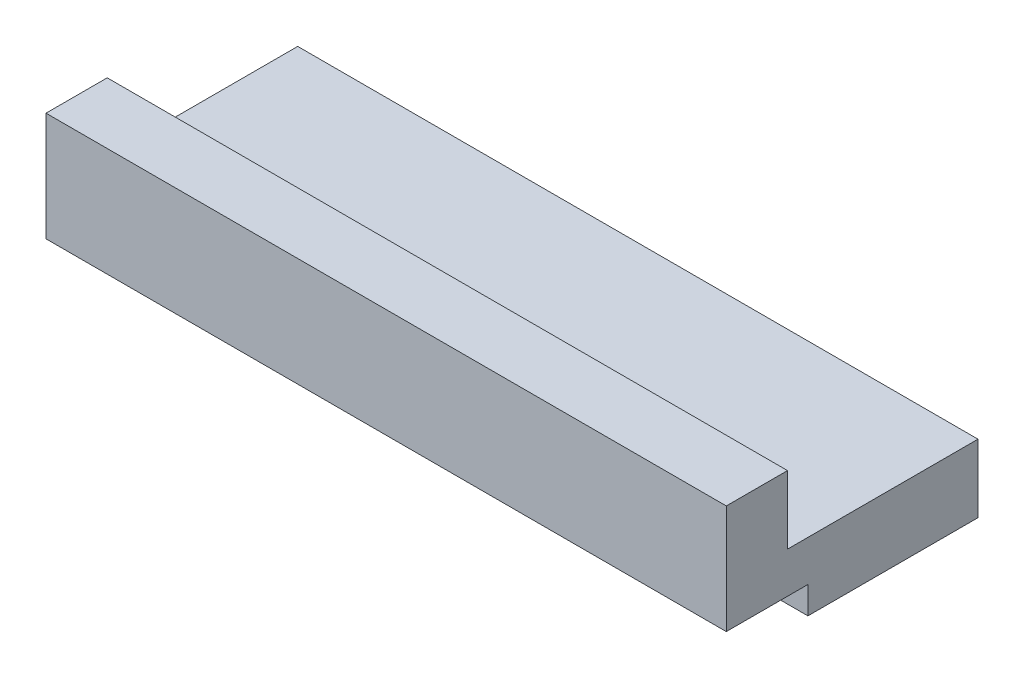
ISO-10303-21;
HEADER;
FILE_DESCRIPTION(('STEP AP214'),'2;1');
FILE_NAME('part.step','',(''),(''),'','','');
FILE_SCHEMA(('AUTOMOTIVE_DESIGN { 1 0 10303 214 1 1 1 1 }'));
ENDSEC;
DATA;
#1=APPLICATION_CONTEXT('core data for automotive mechanical design processes');
#2=APPLICATION_PROTOCOL_DEFINITION('international standard','automotive_design',2000,#1);
#3=PRODUCT_CONTEXT('',#1,'mechanical');
#4=PRODUCT('Part','Part','',(#3));
#5=PRODUCT_RELATED_PRODUCT_CATEGORY('part','',(#4));
#6=PRODUCT_DEFINITION_FORMATION('','',#4);
#7=PRODUCT_DEFINITION_CONTEXT('part definition',#1,'design');
#8=PRODUCT_DEFINITION('design','',#6,#7);
#9=PRODUCT_DEFINITION_SHAPE('','',#8);
#10=(LENGTH_UNIT() NAMED_UNIT(*) SI_UNIT(.MILLI.,.METRE.));
#11=(NAMED_UNIT(*) PLANE_ANGLE_UNIT() SI_UNIT($,.RADIAN.));
#12=(NAMED_UNIT(*) SI_UNIT($,.STERADIAN.) SOLID_ANGLE_UNIT());
#13=UNCERTAINTY_MEASURE_WITH_UNIT(LENGTH_MEASURE(1.E-05),#10,'distance_accuracy_value','');
#14=(GEOMETRIC_REPRESENTATION_CONTEXT(3) GLOBAL_UNCERTAINTY_ASSIGNED_CONTEXT((#13)) GLOBAL_UNIT_ASSIGNED_CONTEXT((#10,
#11,#12)) REPRESENTATION_CONTEXT('',''));
#15=CARTESIAN_POINT('',(0.,0.,0.));
#16=DIRECTION('',(0.,0.,1.));
#17=DIRECTION('',(1.,0.,0.));
#18=AXIS2_PLACEMENT_3D('',#15,#16,#17);
#19=CARTESIAN_POINT('',(-15.0860606060606,4.064,-2.6939393939394));
#20=DIRECTION('',(0.,0.,1.));
#21=DIRECTION('',(1.,0.,0.));
#22=AXIS2_PLACEMENT_3D('',#19,#20,#21);
#23=PLANE('',#22);
#24=DIRECTION('',(1.,0.,0.));
#25=VECTOR('',#24,1.);
#26=CARTESIAN_POINT('',(-15.0860606060606,1.524,-2.6939393939394));
#27=LINE('',#26,#25);
#28=CARTESIAN_POINT('',(-15.0860606060606,1.524,-2.6939393939394));
#29=VERTEX_POINT('',#28);
#30=CARTESIAN_POINT('',(10.3139393939394,1.524,-2.6939393939394));
#31=VERTEX_POINT('',#30);
#32=EDGE_CURVE('E50',#29,#31,#27,.T.);
#33=ORIENTED_EDGE('',*,*,#32,.F.);
#34=DIRECTION('',(0.,-1.,0.));
#35=VECTOR('',#34,1.);
#36=CARTESIAN_POINT('',(-15.0860606060606,4.064,-2.6939393939394));
#37=LINE('',#36,#35);
#38=CARTESIAN_POINT('',(-15.0860606060606,4.064,-2.6939393939394));
#39=VERTEX_POINT('',#38);
#40=EDGE_CURVE('E158',#39,#29,#37,.T.);
#41=ORIENTED_EDGE('',*,*,#40,.F.);
#42=DIRECTION('',(-1.,0.,0.));
#43=VECTOR('',#42,1.);
#44=CARTESIAN_POINT('',(-15.0860606060606,4.064,-2.6939393939394));
#45=LINE('',#44,#43);
#46=CARTESIAN_POINT('',(10.3139393939394,4.064,-2.6939393939394));
#47=VERTEX_POINT('',#46);
#48=EDGE_CURVE('E59',#47,#39,#45,.T.);
#49=ORIENTED_EDGE('',*,*,#48,.F.);
#50=DIRECTION('',(0.,-1.,0.));
#51=VECTOR('',#50,1.);
#52=CARTESIAN_POINT('',(10.3139393939394,4.064,-2.6939393939394));
#53=LINE('',#52,#51);
#54=EDGE_CURVE('E163',#47,#31,#53,.T.);
#55=ORIENTED_EDGE('',*,*,#54,.T.);
#56=EDGE_LOOP('',(#33,#41,#49,#55));
#57=FACE_BOUND('',#56,.T.);
#58=ADVANCED_FACE('F35',(#57),#23,.F.);
#59=CARTESIAN_POINT('',(-15.0860606060606,4.064,-0.407939393939396));
#60=DIRECTION('',(1.,0.,0.));
#61=DIRECTION('',(0.,0.,-1.));
#62=AXIS2_PLACEMENT_3D('',#59,#60,#61);
#63=PLANE('',#62);
#64=DIRECTION('',(0.,0.,1.));
#65=VECTOR('',#64,1.);
#66=CARTESIAN_POINT('',(-15.0860606060606,-1.016,-9.8059393939394));
#67=LINE('',#66,#65);
#68=CARTESIAN_POINT('',(-15.0860606060606,-1.016,-9.8059393939394));
#69=VERTEX_POINT('',#68);
#70=CARTESIAN_POINT('',(-15.0860606060606,-1.016,-3.4559393939394));
#71=VERTEX_POINT('',#70);
#72=EDGE_CURVE('E128',#69,#71,#67,.T.);
#73=ORIENTED_EDGE('',*,*,#72,.T.);
#74=DIRECTION('',(0.,-1.,0.));
#75=VECTOR('',#74,1.);
#76=CARTESIAN_POINT('',(-15.0860606060606,-1.016,-3.4559393939394));
#77=LINE('',#76,#75);
#78=CARTESIAN_POINT('',(-15.0860606060606,0.,-3.4559393939394));
#79=VERTEX_POINT('',#78);
#80=EDGE_CURVE('E119',#79,#71,#77,.T.);
#81=ORIENTED_EDGE('',*,*,#80,.F.);
#82=DIRECTION('',(0.,0.,1.));
#83=VECTOR('',#82,1.);
#84=CARTESIAN_POINT('',(-15.0860606060606,0.,-0.407939393939396));
#85=LINE('',#84,#83);
#86=CARTESIAN_POINT('',(-15.0860606060606,0.,-0.407939393939396));
#87=VERTEX_POINT('',#86);
#88=EDGE_CURVE('E106',#79,#87,#85,.T.);
#89=ORIENTED_EDGE('',*,*,#88,.T.);
#90=DIRECTION('',(0.,-1.,0.));
#91=VECTOR('',#90,1.);
#92=CARTESIAN_POINT('',(-15.0860606060606,4.064,-0.407939393939396));
#93=LINE('',#92,#91);
#94=CARTESIAN_POINT('',(-15.0860606060606,4.064,-0.407939393939396));
#95=VERTEX_POINT('',#94);
#96=EDGE_CURVE('E11',#95,#87,#93,.T.);
#97=ORIENTED_EDGE('',*,*,#96,.F.);
#98=DIRECTION('',(0.,0.,1.));
#99=VECTOR('',#98,1.);
#100=CARTESIAN_POINT('',(-15.0860606060606,4.064,-0.407939393939396));
#101=LINE('',#100,#99);
#102=EDGE_CURVE('E152',#39,#95,#101,.T.);
#103=ORIENTED_EDGE('',*,*,#102,.F.);
#104=ORIENTED_EDGE('',*,*,#40,.T.);
#105=DIRECTION('',(0.,0.,1.));
#106=VECTOR('',#105,1.);
#107=CARTESIAN_POINT('',(-15.0860606060606,1.524,-9.8059393939394));
#108=LINE('',#107,#106);
#109=CARTESIAN_POINT('',(-15.0860606060606,1.524,-9.8059393939394));
#110=VERTEX_POINT('',#109);
#111=EDGE_CURVE('E114',#110,#29,#108,.T.);
#112=ORIENTED_EDGE('',*,*,#111,.F.);
#113=DIRECTION('',(0.,1.,0.));
#114=VECTOR('',#113,1.);
#115=CARTESIAN_POINT('',(-15.0860606060606,1.524,-9.8059393939394));
#116=LINE('',#115,#114);
#117=EDGE_CURVE('E133',#69,#110,#116,.T.);
#118=ORIENTED_EDGE('',*,*,#117,.F.);
#119=EDGE_LOOP('',(#73,#81,#89,#97,#103,#104,#112,#118));
#120=FACE_BOUND('',#119,.T.);
#121=ADVANCED_FACE('F37',(#120),#63,.F.);
#122=CARTESIAN_POINT('',(-15.0860606060606,4.064,-0.407939393939396));
#123=DIRECTION('',(0.,0.,-1.));
#124=DIRECTION('',(-1.,0.,0.));
#125=AXIS2_PLACEMENT_3D('',#122,#123,#124);
#126=PLANE('',#125);
#127=DIRECTION('',(1.,0.,0.));
#128=VECTOR('',#127,1.);
#129=CARTESIAN_POINT('',(-15.0860606060606,0.,-0.407939393939396));
#130=LINE('',#129,#128);
#131=CARTESIAN_POINT('',(10.3139393939394,0.,-0.407939393939396));
#132=VERTEX_POINT('',#131);
#133=EDGE_CURVE('E72',#87,#132,#130,.T.);
#134=ORIENTED_EDGE('',*,*,#133,.T.);
#135=DIRECTION('',(0.,-1.,0.));
#136=VECTOR('',#135,1.);
#137=CARTESIAN_POINT('',(10.3139393939394,4.064,-0.407939393939396));
#138=LINE('',#137,#136);
#139=CARTESIAN_POINT('',(10.3139393939394,4.064,-0.407939393939396));
#140=VERTEX_POINT('',#139);
#141=EDGE_CURVE('E43',#140,#132,#138,.T.);
#142=ORIENTED_EDGE('',*,*,#141,.F.);
#143=DIRECTION('',(1.,0.,0.));
#144=VECTOR('',#143,1.);
#145=CARTESIAN_POINT('',(-15.0860606060606,4.064,-0.407939393939396));
#146=LINE('',#145,#144);
#147=EDGE_CURVE('E77',#95,#140,#146,.T.);
#148=ORIENTED_EDGE('',*,*,#147,.F.);
#149=ORIENTED_EDGE('',*,*,#96,.T.);
#150=EDGE_LOOP('',(#134,#142,#148,#149));
#151=FACE_BOUND('',#150,.T.);
#152=ADVANCED_FACE('F168',(#151),#126,.F.);
#153=CARTESIAN_POINT('',(10.3139393939394,4.064,-0.407939393939396));
#154=DIRECTION('',(-1.,0.,0.));
#155=DIRECTION('',(0.,0.,1.));
#156=AXIS2_PLACEMENT_3D('',#153,#154,#155);
#157=PLANE('',#156);
#158=DIRECTION('',(0.,0.,-1.));
#159=VECTOR('',#158,1.);
#160=CARTESIAN_POINT('',(10.3139393939394,0.,-0.407939393939396));
#161=LINE('',#160,#159);
#162=CARTESIAN_POINT('',(10.3139393939394,0.,-3.4559393939394));
#163=VERTEX_POINT('',#162);
#164=EDGE_CURVE('E154',#132,#163,#161,.T.);
#165=ORIENTED_EDGE('',*,*,#164,.T.);
#166=DIRECTION('',(0.,-1.,0.));
#167=VECTOR('',#166,1.);
#168=CARTESIAN_POINT('',(10.3139393939394,4.064,-3.4559393939394));
#169=LINE('',#168,#167);
#170=CARTESIAN_POINT('',(10.3139393939394,-1.016,-3.4559393939394));
#171=VERTEX_POINT('',#170);
#172=EDGE_CURVE('E122',#163,#171,#169,.T.);
#173=ORIENTED_EDGE('',*,*,#172,.T.);
#174=DIRECTION('',(0.,0.,1.));
#175=VECTOR('',#174,1.);
#176=CARTESIAN_POINT('',(10.3139393939394,-1.016,-9.8059393939394));
#177=LINE('',#176,#175);
#178=CARTESIAN_POINT('',(10.3139393939394,-1.016,-9.8059393939394));
#179=VERTEX_POINT('',#178);
#180=EDGE_CURVE('E144',#179,#171,#177,.T.);
#181=ORIENTED_EDGE('',*,*,#180,.F.);
#182=DIRECTION('',(0.,-1.,0.));
#183=VECTOR('',#182,1.);
#184=CARTESIAN_POINT('',(10.3139393939394,1.524,-9.8059393939394));
#185=LINE('',#184,#183);
#186=CARTESIAN_POINT('',(10.3139393939394,1.524,-9.8059393939394));
#187=VERTEX_POINT('',#186);
#188=EDGE_CURVE('E138',#187,#179,#185,.T.);
#189=ORIENTED_EDGE('',*,*,#188,.F.);
#190=DIRECTION('',(0.,0.,1.));
#191=VECTOR('',#190,1.);
#192=CARTESIAN_POINT('',(10.3139393939394,1.524,-9.8059393939394));
#193=LINE('',#192,#191);
#194=EDGE_CURVE('E147',#187,#31,#193,.T.);
#195=ORIENTED_EDGE('',*,*,#194,.T.);
#196=ORIENTED_EDGE('',*,*,#54,.F.);
#197=DIRECTION('',(0.,0.,-1.));
#198=VECTOR('',#197,1.);
#199=CARTESIAN_POINT('',(10.3139393939394,4.064,-0.407939393939396));
#200=LINE('',#199,#198);
#201=EDGE_CURVE('E156',#140,#47,#200,.T.);
#202=ORIENTED_EDGE('',*,*,#201,.F.);
#203=ORIENTED_EDGE('',*,*,#141,.T.);
#204=EDGE_LOOP('',(#165,#173,#181,#189,#195,#196,#202,#203));
#205=FACE_BOUND('',#204,.T.);
#206=ADVANCED_FACE('F166',(#205),#157,.F.);
#207=CARTESIAN_POINT('',(0.,4.064,0.));
#208=DIRECTION('',(0.,-1.,0.));
#209=DIRECTION('',(0.,0.,-1.));
#210=AXIS2_PLACEMENT_3D('',#207,#208,#209);
#211=PLANE('',#210);
#212=ORIENTED_EDGE('',*,*,#102,.T.);
#213=ORIENTED_EDGE('',*,*,#147,.T.);
#214=ORIENTED_EDGE('',*,*,#201,.T.);
#215=ORIENTED_EDGE('',*,*,#48,.T.);
#216=EDGE_LOOP('',(#212,#213,#214,#215));
#217=FACE_BOUND('',#216,.T.);
#218=ADVANCED_FACE('F174',(#217),#211,.F.);
#219=CARTESIAN_POINT('',(0.,0.,0.));
#220=DIRECTION('',(0.,-1.,0.));
#221=DIRECTION('',(0.,0.,-1.));
#222=AXIS2_PLACEMENT_3D('',#219,#220,#221);
#223=PLANE('',#222);
#224=ORIENTED_EDGE('',*,*,#88,.F.);
#225=DIRECTION('',(-1.,0.,0.));
#226=VECTOR('',#225,1.);
#227=CARTESIAN_POINT('',(15.6479393939394,0.,-3.4559393939394));
#228=LINE('',#227,#226);
#229=EDGE_CURVE('E110',#163,#79,#228,.T.);
#230=ORIENTED_EDGE('',*,*,#229,.F.);
#231=ORIENTED_EDGE('',*,*,#164,.F.);
#232=ORIENTED_EDGE('',*,*,#133,.F.);
#233=EDGE_LOOP('',(#224,#230,#231,#232));
#234=FACE_BOUND('',#233,.T.);
#235=ADVANCED_FACE('F108',(#234),#223,.T.);
#236=CARTESIAN_POINT('',(-15.0860606060606,1.524,-9.8059393939394));
#237=DIRECTION('',(0.,-1.,0.));
#238=DIRECTION('',(1.,0.,0.));
#239=AXIS2_PLACEMENT_3D('',#236,#237,#238);
#240=PLANE('',#239);
#241=ORIENTED_EDGE('',*,*,#32,.T.);
#242=ORIENTED_EDGE('',*,*,#194,.F.);
#243=DIRECTION('',(1.,0.,0.));
#244=VECTOR('',#243,1.);
#245=CARTESIAN_POINT('',(-15.0860606060606,1.524,-9.8059393939394));
#246=LINE('',#245,#244);
#247=EDGE_CURVE('E136',#110,#187,#246,.T.);
#248=ORIENTED_EDGE('',*,*,#247,.F.);
#249=ORIENTED_EDGE('',*,*,#111,.T.);
#250=EDGE_LOOP('',(#241,#242,#248,#249));
#251=FACE_BOUND('',#250,.T.);
#252=ADVANCED_FACE('F183',(#251),#240,.F.);
#253=CARTESIAN_POINT('',(-15.0860606060606,-1.016,-9.8059393939394));
#254=DIRECTION('',(0.,1.,0.));
#255=DIRECTION('',(-1.,0.,0.));
#256=AXIS2_PLACEMENT_3D('',#253,#254,#255);
#257=PLANE('',#256);
#258=ORIENTED_EDGE('',*,*,#180,.T.);
#259=DIRECTION('',(-1.,0.,0.));
#260=VECTOR('',#259,1.);
#261=CARTESIAN_POINT('',(15.6479393939394,-1.016,-3.4559393939394));
#262=LINE('',#261,#260);
#263=EDGE_CURVE('E123',#171,#71,#262,.T.);
#264=ORIENTED_EDGE('',*,*,#263,.T.);
#265=ORIENTED_EDGE('',*,*,#72,.F.);
#266=DIRECTION('',(-1.,0.,0.));
#267=VECTOR('',#266,1.);
#268=CARTESIAN_POINT('',(-15.0860606060606,-1.016,-9.8059393939394));
#269=LINE('',#268,#267);
#270=EDGE_CURVE('E140',#179,#69,#269,.T.);
#271=ORIENTED_EDGE('',*,*,#270,.F.);
#272=EDGE_LOOP('',(#258,#264,#265,#271));
#273=FACE_BOUND('',#272,.T.);
#274=ADVANCED_FACE('F188',(#273),#257,.F.);
#275=CARTESIAN_POINT('',(0.,0.,-9.8059393939394));
#276=DIRECTION('',(0.,0.,1.));
#277=DIRECTION('',(1.,0.,0.));
#278=AXIS2_PLACEMENT_3D('',#275,#276,#277);
#279=PLANE('',#278);
#280=ORIENTED_EDGE('',*,*,#117,.T.);
#281=ORIENTED_EDGE('',*,*,#247,.T.);
#282=ORIENTED_EDGE('',*,*,#188,.T.);
#283=ORIENTED_EDGE('',*,*,#270,.T.);
#284=EDGE_LOOP('',(#280,#281,#282,#283));
#285=FACE_BOUND('',#284,.T.);
#286=ADVANCED_FACE('F192',(#285),#279,.F.);
#287=CARTESIAN_POINT('',(15.6479393939394,-1.016,-3.4559393939394));
#288=DIRECTION('',(0.,0.,-1.));
#289=DIRECTION('',(-1.,0.,0.));
#290=AXIS2_PLACEMENT_3D('',#287,#288,#289);
#291=PLANE('',#290);
#292=ORIENTED_EDGE('',*,*,#229,.T.);
#293=ORIENTED_EDGE('',*,*,#80,.T.);
#294=ORIENTED_EDGE('',*,*,#263,.F.);
#295=ORIENTED_EDGE('',*,*,#172,.F.);
#296=EDGE_LOOP('',(#292,#293,#294,#295));
#297=FACE_BOUND('',#296,.T.);
#298=ADVANCED_FACE('F118',(#297),#291,.F.);
#299=CLOSED_SHELL('',(#58,#121,#152,#206,#218,#235,#252,#274,#286,#298));
#300=MANIFOLD_SOLID_BREP('B2',#299);
#301=ADVANCED_BREP_SHAPE_REPRESENTATION('',(#18,#300),#14);
#302=SHAPE_DEFINITION_REPRESENTATION(#9,#301);
ENDSEC;
END-ISO-10303-21;
